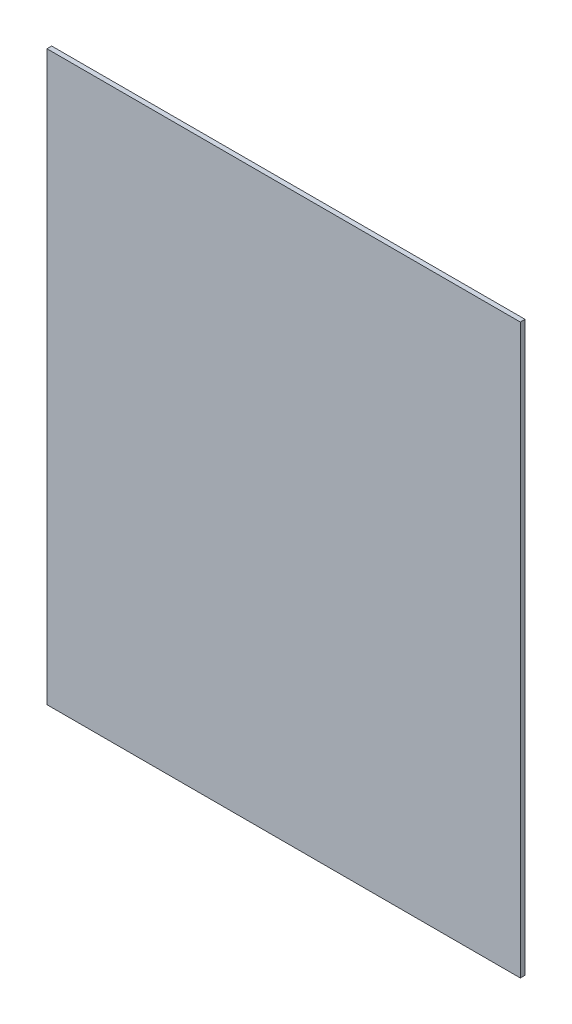
ISO-10303-21;
HEADER;
FILE_DESCRIPTION(('STEP AP214'),'2;1');
FILE_NAME('part.step','',(''),(''),'','','');
FILE_SCHEMA(('AUTOMOTIVE_DESIGN { 1 0 10303 214 1 1 1 1 }'));
ENDSEC;
DATA;
#1=APPLICATION_CONTEXT('core data for automotive mechanical design processes');
#2=APPLICATION_PROTOCOL_DEFINITION('international standard','automotive_design',2000,#1);
#3=PRODUCT_CONTEXT('',#1,'mechanical');
#4=PRODUCT('Part','Part','',(#3));
#5=PRODUCT_RELATED_PRODUCT_CATEGORY('part','',(#4));
#6=PRODUCT_DEFINITION_FORMATION('','',#4);
#7=PRODUCT_DEFINITION_CONTEXT('part definition',#1,'design');
#8=PRODUCT_DEFINITION('design','',#6,#7);
#9=PRODUCT_DEFINITION_SHAPE('','',#8);
#10=(LENGTH_UNIT() NAMED_UNIT(*) SI_UNIT(.MILLI.,.METRE.));
#11=(NAMED_UNIT(*) PLANE_ANGLE_UNIT() SI_UNIT($,.RADIAN.));
#12=(NAMED_UNIT(*) SI_UNIT($,.STERADIAN.) SOLID_ANGLE_UNIT());
#13=UNCERTAINTY_MEASURE_WITH_UNIT(LENGTH_MEASURE(1.E-05),#10,'distance_accuracy_value','');
#14=(GEOMETRIC_REPRESENTATION_CONTEXT(3) GLOBAL_UNCERTAINTY_ASSIGNED_CONTEXT((#13)) GLOBAL_UNIT_ASSIGNED_CONTEXT((#10,
#11,#12)) REPRESENTATION_CONTEXT('',''));
#15=CARTESIAN_POINT('',(0.,0.,0.));
#16=DIRECTION('',(0.,0.,1.));
#17=DIRECTION('',(1.,0.,0.));
#18=AXIS2_PLACEMENT_3D('',#15,#16,#17);
#19=CARTESIAN_POINT('',(-250.,-300.,5.));
#20=DIRECTION('',(0.,1.,0.));
#21=DIRECTION('',(0.,0.,1.));
#22=AXIS2_PLACEMENT_3D('',#19,#20,#21);
#23=PLANE('',#22);
#24=DIRECTION('',(1.,0.,0.));
#25=VECTOR('',#24,1.);
#26=CARTESIAN_POINT('',(-250.,-300.,0.));
#27=LINE('',#26,#25);
#28=CARTESIAN_POINT('',(-250.,-300.,0.));
#29=VERTEX_POINT('',#28);
#30=CARTESIAN_POINT('',(250.,-300.,0.));
#31=VERTEX_POINT('',#30);
#32=EDGE_CURVE('E96',#29,#31,#27,.T.);
#33=ORIENTED_EDGE('',*,*,#32,.T.);
#34=DIRECTION('',(0.,0.,-1.));
#35=VECTOR('',#34,1.);
#36=CARTESIAN_POINT('',(250.,-300.,5.));
#37=LINE('',#36,#35);
#38=CARTESIAN_POINT('',(250.,-300.,5.));
#39=VERTEX_POINT('',#38);
#40=EDGE_CURVE('E11',#39,#31,#37,.T.);
#41=ORIENTED_EDGE('',*,*,#40,.F.);
#42=DIRECTION('',(1.,0.,0.));
#43=VECTOR('',#42,1.);
#44=CARTESIAN_POINT('',(-250.,-300.,5.));
#45=LINE('',#44,#43);
#46=CARTESIAN_POINT('',(-250.,-300.,5.));
#47=VERTEX_POINT('',#46);
#48=EDGE_CURVE('E84',#47,#39,#45,.T.);
#49=ORIENTED_EDGE('',*,*,#48,.F.);
#50=DIRECTION('',(0.,0.,-1.));
#51=VECTOR('',#50,1.);
#52=CARTESIAN_POINT('',(-250.,-300.,5.));
#53=LINE('',#52,#51);
#54=EDGE_CURVE('E92',#47,#29,#53,.T.);
#55=ORIENTED_EDGE('',*,*,#54,.T.);
#56=EDGE_LOOP('',(#33,#41,#49,#55));
#57=FACE_BOUND('',#56,.T.);
#58=ADVANCED_FACE('F33',(#57),#23,.F.);
#59=CARTESIAN_POINT('',(250.,-300.,5.));
#60=DIRECTION('',(-1.,0.,0.));
#61=DIRECTION('',(0.,0.,1.));
#62=AXIS2_PLACEMENT_3D('',#59,#60,#61);
#63=PLANE('',#62);
#64=DIRECTION('',(0.,1.,0.));
#65=VECTOR('',#64,1.);
#66=CARTESIAN_POINT('',(250.,-300.,0.));
#67=LINE('',#66,#65);
#68=CARTESIAN_POINT('',(250.,300.,0.));
#69=VERTEX_POINT('',#68);
#70=EDGE_CURVE('E88',#31,#69,#67,.T.);
#71=ORIENTED_EDGE('',*,*,#70,.T.);
#72=DIRECTION('',(0.,0.,-1.));
#73=VECTOR('',#72,1.);
#74=CARTESIAN_POINT('',(250.,300.,5.));
#75=LINE('',#74,#73);
#76=CARTESIAN_POINT('',(250.,300.,5.));
#77=VERTEX_POINT('',#76);
#78=EDGE_CURVE('E41',#77,#69,#75,.T.);
#79=ORIENTED_EDGE('',*,*,#78,.F.);
#80=DIRECTION('',(0.,1.,0.));
#81=VECTOR('',#80,1.);
#82=CARTESIAN_POINT('',(250.,-300.,5.));
#83=LINE('',#82,#81);
#84=EDGE_CURVE('E79',#39,#77,#83,.T.);
#85=ORIENTED_EDGE('',*,*,#84,.F.);
#86=ORIENTED_EDGE('',*,*,#40,.T.);
#87=EDGE_LOOP('',(#71,#79,#85,#86));
#88=FACE_BOUND('',#87,.T.);
#89=ADVANCED_FACE('F87',(#88),#63,.F.);
#90=CARTESIAN_POINT('',(-250.,300.,5.));
#91=DIRECTION('',(0.,-1.,0.));
#92=DIRECTION('',(1.,0.,0.));
#93=AXIS2_PLACEMENT_3D('',#90,#91,#92);
#94=PLANE('',#93);
#95=DIRECTION('',(-1.,0.,0.));
#96=VECTOR('',#95,1.);
#97=CARTESIAN_POINT('',(-250.,300.,0.));
#98=LINE('',#97,#96);
#99=CARTESIAN_POINT('',(-250.,300.,0.));
#100=VERTEX_POINT('',#99);
#101=EDGE_CURVE('E66',#69,#100,#98,.T.);
#102=ORIENTED_EDGE('',*,*,#101,.T.);
#103=DIRECTION('',(0.,0.,-1.));
#104=VECTOR('',#103,1.);
#105=CARTESIAN_POINT('',(-250.,300.,5.));
#106=LINE('',#105,#104);
#107=CARTESIAN_POINT('',(-250.,300.,5.));
#108=VERTEX_POINT('',#107);
#109=EDGE_CURVE('E89',#108,#100,#106,.T.);
#110=ORIENTED_EDGE('',*,*,#109,.F.);
#111=DIRECTION('',(-1.,0.,0.));
#112=VECTOR('',#111,1.);
#113=CARTESIAN_POINT('',(-250.,300.,5.));
#114=LINE('',#113,#112);
#115=EDGE_CURVE('E82',#77,#108,#114,.T.);
#116=ORIENTED_EDGE('',*,*,#115,.F.);
#117=ORIENTED_EDGE('',*,*,#78,.T.);
#118=EDGE_LOOP('',(#102,#110,#116,#117));
#119=FACE_BOUND('',#118,.T.);
#120=ADVANCED_FACE('F90',(#119),#94,.F.);
#121=CARTESIAN_POINT('',(-250.,-300.,5.));
#122=DIRECTION('',(1.,0.,0.));
#123=DIRECTION('',(0.,0.,-1.));
#124=AXIS2_PLACEMENT_3D('',#121,#122,#123);
#125=PLANE('',#124);
#126=DIRECTION('',(0.,-1.,0.));
#127=VECTOR('',#126,1.);
#128=CARTESIAN_POINT('',(-250.,-300.,0.));
#129=LINE('',#128,#127);
#130=EDGE_CURVE('E72',#100,#29,#129,.T.);
#131=ORIENTED_EDGE('',*,*,#130,.T.);
#132=ORIENTED_EDGE('',*,*,#54,.F.);
#133=DIRECTION('',(0.,-1.,0.));
#134=VECTOR('',#133,1.);
#135=CARTESIAN_POINT('',(-250.,-300.,5.));
#136=LINE('',#135,#134);
#137=EDGE_CURVE('E49',#108,#47,#136,.T.);
#138=ORIENTED_EDGE('',*,*,#137,.F.);
#139=ORIENTED_EDGE('',*,*,#109,.T.);
#140=EDGE_LOOP('',(#131,#132,#138,#139));
#141=FACE_BOUND('',#140,.T.);
#142=ADVANCED_FACE('F103',(#141),#125,.F.);
#143=CARTESIAN_POINT('',(0.,0.,5.));
#144=DIRECTION('',(0.,0.,1.));
#145=DIRECTION('',(1.,0.,0.));
#146=AXIS2_PLACEMENT_3D('',#143,#144,#145);
#147=PLANE('',#146);
#148=ORIENTED_EDGE('',*,*,#48,.T.);
#149=ORIENTED_EDGE('',*,*,#84,.T.);
#150=ORIENTED_EDGE('',*,*,#115,.T.);
#151=ORIENTED_EDGE('',*,*,#137,.T.);
#152=EDGE_LOOP('',(#148,#149,#150,#151));
#153=FACE_BOUND('',#152,.T.);
#154=ADVANCED_FACE('F80',(#153),#147,.T.);
#155=CARTESIAN_POINT('',(0.,0.,0.));
#156=DIRECTION('',(0.,0.,1.));
#157=DIRECTION('',(1.,0.,0.));
#158=AXIS2_PLACEMENT_3D('',#155,#156,#157);
#159=PLANE('',#158);
#160=ORIENTED_EDGE('',*,*,#32,.F.);
#161=ORIENTED_EDGE('',*,*,#130,.F.);
#162=ORIENTED_EDGE('',*,*,#101,.F.);
#163=ORIENTED_EDGE('',*,*,#70,.F.);
#164=EDGE_LOOP('',(#160,#161,#162,#163));
#165=FACE_BOUND('',#164,.T.);
#166=ADVANCED_FACE('F106',(#165),#159,.F.);
#167=CLOSED_SHELL('',(#58,#89,#120,#142,#154,#166));
#168=MANIFOLD_SOLID_BREP('B2',#167);
#169=ADVANCED_BREP_SHAPE_REPRESENTATION('',(#18,#168),#14);
#170=SHAPE_DEFINITION_REPRESENTATION(#9,#169);
ENDSEC;
END-ISO-10303-21;
